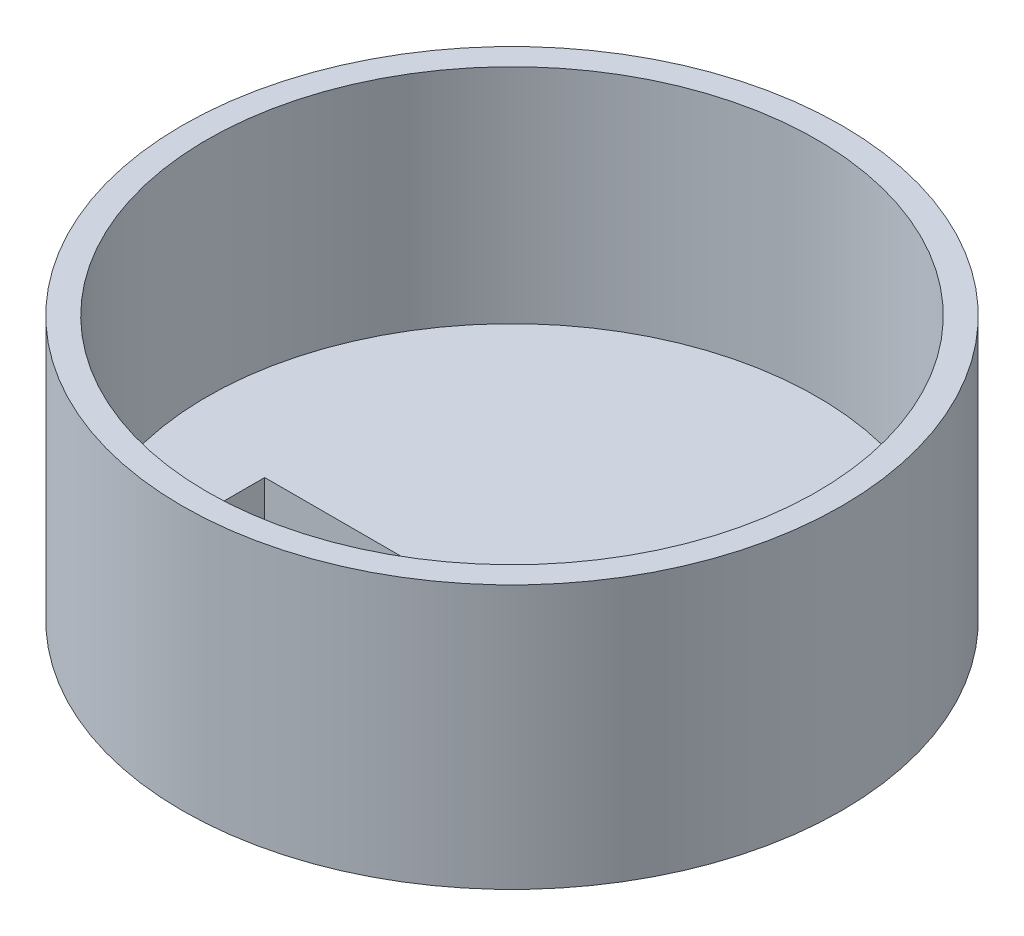
ISO-10303-21;
HEADER;
FILE_DESCRIPTION(('STEP AP214'),'2;1');
FILE_NAME('part.step','',(''),(''),'','','');
FILE_SCHEMA(('AUTOMOTIVE_DESIGN { 1 0 10303 214 1 1 1 1 }'));
ENDSEC;
DATA;
#1=APPLICATION_CONTEXT('core data for automotive mechanical design processes');
#2=APPLICATION_PROTOCOL_DEFINITION('international standard','automotive_design',2000,#1);
#3=PRODUCT_CONTEXT('',#1,'mechanical');
#4=PRODUCT('Part','Part','',(#3));
#5=PRODUCT_RELATED_PRODUCT_CATEGORY('part','',(#4));
#6=PRODUCT_DEFINITION_FORMATION('','',#4);
#7=PRODUCT_DEFINITION_CONTEXT('part definition',#1,'design');
#8=PRODUCT_DEFINITION('design','',#6,#7);
#9=PRODUCT_DEFINITION_SHAPE('','',#8);
#10=(LENGTH_UNIT() NAMED_UNIT(*) SI_UNIT(.MILLI.,.METRE.));
#11=(NAMED_UNIT(*) PLANE_ANGLE_UNIT() SI_UNIT($,.RADIAN.));
#12=(NAMED_UNIT(*) SI_UNIT($,.STERADIAN.) SOLID_ANGLE_UNIT());
#13=UNCERTAINTY_MEASURE_WITH_UNIT(LENGTH_MEASURE(1.E-05),#10,'distance_accuracy_value','');
#14=(GEOMETRIC_REPRESENTATION_CONTEXT(3) GLOBAL_UNCERTAINTY_ASSIGNED_CONTEXT((#13)) GLOBAL_UNIT_ASSIGNED_CONTEXT((#10,
#11,#12)) REPRESENTATION_CONTEXT('',''));
#15=CARTESIAN_POINT('',(0.,0.,0.));
#16=DIRECTION('',(0.,0.,1.));
#17=DIRECTION('',(1.,0.,0.));
#18=AXIS2_PLACEMENT_3D('',#15,#16,#17);
#19=CARTESIAN_POINT('',(-5.36210035518009,-1.,23.4390150982303));
#20=DIRECTION('',(0.,1.,0.));
#21=DIRECTION('',(0.,0.,1.));
#22=AXIS2_PLACEMENT_3D('',#19,#20,#21);
#23=PLANE('',#22);
#24=DIRECTION('',(0.,0.,1.));
#25=VECTOR('',#24,1.);
#26=CARTESIAN_POINT('',(-3.5,-1.,2.49999999999999));
#27=LINE('',#26,#25);
#28=CARTESIAN_POINT('',(-3.5,-1.,2.49999999999999));
#29=VERTEX_POINT('',#28);
#30=CARTESIAN_POINT('',(-3.5,-1.,17.5));
#31=VERTEX_POINT('',#30);
#32=EDGE_CURVE('E255',#29,#31,#27,.T.);
#33=ORIENTED_EDGE('',*,*,#32,.F.);
#34=DIRECTION('',(1.,0.,0.));
#35=VECTOR('',#34,1.);
#36=CARTESIAN_POINT('',(-3.5,-1.,2.49999999999999));
#37=LINE('',#36,#35);
#38=CARTESIAN_POINT('',(-26.5,-1.,2.49999999999999));
#39=VERTEX_POINT('',#38);
#40=EDGE_CURVE('E261',#39,#29,#37,.T.);
#41=ORIENTED_EDGE('',*,*,#40,.F.);
#42=DIRECTION('',(0.,0.,-1.));
#43=VECTOR('',#42,1.);
#44=CARTESIAN_POINT('',(-26.5,-1.,2.49999999999999));
#45=LINE('',#44,#43);
#46=CARTESIAN_POINT('',(-26.5,-1.,17.5));
#47=VERTEX_POINT('',#46);
#48=EDGE_CURVE('E278',#47,#39,#45,.T.);
#49=ORIENTED_EDGE('',*,*,#48,.F.);
#50=DIRECTION('',(-1.,0.,0.));
#51=VECTOR('',#50,1.);
#52=CARTESIAN_POINT('',(-3.5,-1.,17.5));
#53=LINE('',#52,#51);
#54=EDGE_CURVE('E274',#31,#47,#53,.T.);
#55=ORIENTED_EDGE('',*,*,#54,.F.);
#56=EDGE_LOOP('',(#33,#41,#49,#55));
#57=FACE_BOUND('',#56,.T.);
#58=CARTESIAN_POINT('',(2.58566802347337,-1.,14.3443011778405));
#59=CARTESIAN_POINT('',(1.36427446618725,-1.,8.53444163712361));
#60=CARTESIAN_POINT('',(-0.198470948038561,-1.,-2.10864729613163));
#61=CARTESIAN_POINT('',(13.6703917977117,-1.,0.501799814781554));
#62=CARTESIAN_POINT('',(20.6021686683192,-1.,0.456955561688108));
#63=CARTESIAN_POINT('',(30.7786877169753,-1.,-1.04330020599471));
#64=CARTESIAN_POINT('',(29.8532467146102,-1.,6.72951117522861));
#65=CARTESIAN_POINT('',(29.6566142540288,-1.,12.1804673500477));
#66=CARTESIAN_POINT('',(31.446966250817,-1.,17.236483626006));
#67=CARTESIAN_POINT('',(33.097693761807,-1.,21.9013839704548));
#68=CARTESIAN_POINT('',(27.5452937833511,-1.,26.6466321762266));
#69=CARTESIAN_POINT('',(19.0388734017149,-1.,21.2715981570248));
#70=CARTESIAN_POINT('',(9.31118788829317,-1.,23.9752678048799));
#71=CARTESIAN_POINT('',(-0.0906689007800099,-1.,23.093852030946));
#72=CARTESIAN_POINT('',(-9.38430864422489,-1.,23.9259169166535));
#73=CARTESIAN_POINT('',(-19.1308510356053,-1.,20.634216676677));
#74=CARTESIAN_POINT('',(-27.2654771250594,-1.,26.4098221695751));
#75=CARTESIAN_POINT('',(-33.2986793425028,-1.,21.7489217967745));
#76=CARTESIAN_POINT('',(-31.44206181982,-1.,16.7545588598773));
#77=CARTESIAN_POINT('',(-30.8237725474292,-1.,11.5242588910289));
#78=CARTESIAN_POINT('',(-29.2004302865499,-1.,6.23346714011981));
#79=CARTESIAN_POINT('',(-31.0806900584217,-1.,-0.909954899552583));
#80=CARTESIAN_POINT('',(-24.8199191278998,-1.,0.240703401072045));
#81=CARTESIAN_POINT('',(-19.1478382705035,-1.,0.946963345573386));
#82=CARTESIAN_POINT('',(-12.043202172285,-1.,0.22448474873068));
#83=CARTESIAN_POINT('',(-0.603012826832719,-1.,-1.58946642226845));
#84=CARTESIAN_POINT('',(-0.411714134153386,-1.,10.0019173119475));
#85=CARTESIAN_POINT('',(-2.89651142548242,-1.,18.3933971444393));
#86=CARTESIAN_POINT('',(3.53272235370927,-1.,18.6022645861089));
#87=CARTESIAN_POINT('',(2.86794465016186,-1.,15.68701953664));
#88=CARTESIAN_POINT('',(2.58566802347337,-1.,14.3443011778405));
#89=B_SPLINE_CURVE_WITH_KNOTS('',3,(#58,#59,#60,#61,#62,#63,#64,#65,#66,#67,#68,#69,#70,#71,#72,
#73,#74,#75,#76,#77,#78,#79,#80,#81,#82,#83,#84,#85,#86,#87,#88),.UNSPECIFIED.,.T.,.F.,(4,1,1,1,
1,1,1,1,1,1,1,1,1,1,1,1,1,1,1,1,1,1,1,1,1,1,1,1,4),(0.,0.0716446828108782,0.112352981719703,
0.167635856781071,0.200467621117315,0.225175545360288,0.260861667415498,0.287096674703429,
0.305438816575635,0.328540715766252,0.37335303988331,0.434051312506229,0.473333741811351,
0.513734662105038,0.573284023787942,0.616414277708655,0.643022173000441,0.658048674768701,
0.690377742346138,0.721297129536385,0.748243777610526,0.76583378331187,0.795666761125788,
0.841017232921135,0.87409780991532,0.94543754740781,0.962596858960424,0.983442176141032,1.),.UNSPECIFIED.);
#90=CARTESIAN_POINT('',(2.58566802347337,-1.,14.3443011778405));
#91=VERTEX_POINT('',#90);
#92=EDGE_CURVE('E320',#91,#91,#89,.T.);
#93=ORIENTED_EDGE('',*,*,#92,.T.);
#94=EDGE_LOOP('',(#93));
#95=FACE_BOUND('',#94,.T.);
#96=DIRECTION('',(0.,0.,-1.));
#97=VECTOR('',#96,1.);
#98=CARTESIAN_POINT('',(3.5,-1.,2.5));
#99=LINE('',#98,#97);
#100=CARTESIAN_POINT('',(3.5,-1.,17.5));
#101=VERTEX_POINT('',#100);
#102=CARTESIAN_POINT('',(3.5,-1.,2.5));
#103=VERTEX_POINT('',#102);
#104=EDGE_CURVE('E199',#101,#103,#99,.T.);
#105=ORIENTED_EDGE('',*,*,#104,.F.);
#106=DIRECTION('',(-1.,0.,0.));
#107=VECTOR('',#106,1.);
#108=CARTESIAN_POINT('',(3.5,-1.,17.5));
#109=LINE('',#108,#107);
#110=CARTESIAN_POINT('',(26.5,-1.,17.5));
#111=VERTEX_POINT('',#110);
#112=EDGE_CURVE('E216',#111,#101,#109,.T.);
#113=ORIENTED_EDGE('',*,*,#112,.F.);
#114=DIRECTION('',(0.,0.,1.));
#115=VECTOR('',#114,1.);
#116=CARTESIAN_POINT('',(26.5,-1.,2.5));
#117=LINE('',#116,#115);
#118=CARTESIAN_POINT('',(26.5,-1.,2.5));
#119=VERTEX_POINT('',#118);
#120=EDGE_CURVE('E233',#119,#111,#117,.T.);
#121=ORIENTED_EDGE('',*,*,#120,.F.);
#122=DIRECTION('',(1.,0.,0.));
#123=VECTOR('',#122,1.);
#124=CARTESIAN_POINT('',(3.5,-1.,2.5));
#125=LINE('',#124,#123);
#126=EDGE_CURVE('E229',#103,#119,#125,.T.);
#127=ORIENTED_EDGE('',*,*,#126,.F.);
#128=EDGE_LOOP('',(#105,#113,#121,#127));
#129=FACE_BOUND('',#128,.T.);
#130=ADVANCED_FACE('F45',(#57,#95,#129),#23,.F.);
#131=CARTESIAN_POINT('',(0.,30.,0.));
#132=DIRECTION('',(0.,-1.,0.));
#133=DIRECTION('',(0.,0.,-1.));
#134=AXIS2_PLACEMENT_3D('',#131,#132,#133);
#135=CYLINDRICAL_SURFACE('',#134,40.);
#136=CARTESIAN_POINT('',(0.,30.,0.));
#137=DIRECTION('',(0.,1.,0.));
#138=DIRECTION('',(0.,0.,1.));
#139=AXIS2_PLACEMENT_3D('',#136,#137,#138);
#140=CIRCLE('',#139,40.);
#141=CARTESIAN_POINT('',(0.,30.,40.));
#142=VERTEX_POINT('',#141);
#143=EDGE_CURVE('E725',#142,#142,#140,.T.);
#144=ORIENTED_EDGE('',*,*,#143,.F.);
#145=EDGE_LOOP('',(#144));
#146=FACE_BOUND('',#145,.T.);
#147=CARTESIAN_POINT('',(0.,-2.,0.));
#148=DIRECTION('',(0.,-1.,0.));
#149=DIRECTION('',(0.,0.,-1.));
#150=AXIS2_PLACEMENT_3D('',#147,#148,#149);
#151=CIRCLE('',#150,40.);
#152=CARTESIAN_POINT('',(0.,-2.,-40.));
#153=VERTEX_POINT('',#152);
#154=EDGE_CURVE('E305',#153,#153,#151,.T.);
#155=ORIENTED_EDGE('',*,*,#154,.F.);
#156=EDGE_LOOP('',(#155));
#157=FACE_BOUND('',#156,.T.);
#158=ADVANCED_FACE('F47',(#146,#157),#135,.T.);
#159=CARTESIAN_POINT('',(0.,30.,0.));
#160=DIRECTION('',(0.,1.,0.));
#161=DIRECTION('',(0.,0.,1.));
#162=AXIS2_PLACEMENT_3D('',#159,#160,#161);
#163=PLANE('',#162);
#164=CARTESIAN_POINT('',(0.,30.,0.));
#165=DIRECTION('',(0.,1.,0.));
#166=DIRECTION('',(0.,0.,1.));
#167=AXIS2_PLACEMENT_3D('',#164,#165,#166);
#168=CIRCLE('',#167,37.);
#169=CARTESIAN_POINT('',(0.,30.,37.));
#170=VERTEX_POINT('',#169);
#171=EDGE_CURVE('E730',#170,#170,#168,.T.);
#172=ORIENTED_EDGE('',*,*,#171,.F.);
#173=EDGE_LOOP('',(#172));
#174=FACE_BOUND('',#173,.T.);
#175=ORIENTED_EDGE('',*,*,#143,.T.);
#176=EDGE_LOOP('',(#175));
#177=FACE_BOUND('',#176,.T.);
#178=ADVANCED_FACE('F407',(#174,#177),#163,.T.);
#179=CARTESIAN_POINT('',(0.,3.,0.));
#180=DIRECTION('',(0.,1.,0.));
#181=DIRECTION('',(0.,0.,1.));
#182=AXIS2_PLACEMENT_3D('',#179,#180,#181);
#183=CYLINDRICAL_SURFACE('',#182,37.);
#184=CARTESIAN_POINT('',(0.,3.,0.));
#185=DIRECTION('',(0.,1.,0.));
#186=DIRECTION('',(0.,0.,1.));
#187=AXIS2_PLACEMENT_3D('',#184,#185,#186);
#188=CIRCLE('',#187,37.);
#189=CARTESIAN_POINT('',(0.,3.,37.));
#190=VERTEX_POINT('',#189);
#191=EDGE_CURVE('E729',#190,#190,#188,.T.);
#192=ORIENTED_EDGE('',*,*,#191,.F.);
#193=EDGE_LOOP('',(#192));
#194=FACE_BOUND('',#193,.T.);
#195=ORIENTED_EDGE('',*,*,#171,.T.);
#196=EDGE_LOOP('',(#195));
#197=FACE_BOUND('',#196,.T.);
#198=ADVANCED_FACE('F403',(#194,#197),#183,.F.);
#199=CARTESIAN_POINT('',(0.,3.,0.));
#200=DIRECTION('',(0.,1.,0.));
#201=DIRECTION('',(0.,0.,1.));
#202=AXIS2_PLACEMENT_3D('',#199,#200,#201);
#203=PLANE('',#202);
#204=DIRECTION('',(0.,0.,1.));
#205=VECTOR('',#204,1.);
#206=CARTESIAN_POINT('',(5.,3.,0.));
#207=LINE('',#206,#205);
#208=CARTESIAN_POINT('',(5.,3.,5.));
#209=VERTEX_POINT('',#208);
#210=CARTESIAN_POINT('',(5.,3.,15.));
#211=VERTEX_POINT('',#210);
#212=EDGE_CURVE('E699',#209,#211,#207,.T.);
#213=ORIENTED_EDGE('',*,*,#212,.F.);
#214=DIRECTION('',(-1.,0.,0.));
#215=VECTOR('',#214,1.);
#216=CARTESIAN_POINT('',(0.,3.,5.));
#217=LINE('',#216,#215);
#218=CARTESIAN_POINT('',(25.,3.,5.));
#219=VERTEX_POINT('',#218);
#220=EDGE_CURVE('E709',#219,#209,#217,.T.);
#221=ORIENTED_EDGE('',*,*,#220,.F.);
#222=DIRECTION('',(0.,0.,-1.));
#223=VECTOR('',#222,1.);
#224=CARTESIAN_POINT('',(25.,3.,0.));
#225=LINE('',#224,#223);
#226=CARTESIAN_POINT('',(25.,3.,15.));
#227=VERTEX_POINT('',#226);
#228=EDGE_CURVE('E170',#227,#219,#225,.T.);
#229=ORIENTED_EDGE('',*,*,#228,.F.);
#230=DIRECTION('',(1.,0.,0.));
#231=VECTOR('',#230,1.);
#232=CARTESIAN_POINT('',(0.,3.,15.));
#233=LINE('',#232,#231);
#234=EDGE_CURVE('E701',#211,#227,#233,.T.);
#235=ORIENTED_EDGE('',*,*,#234,.F.);
#236=EDGE_LOOP('',(#213,#221,#229,#235));
#237=FACE_BOUND('',#236,.T.);
#238=DIRECTION('',(0.,0.,-1.));
#239=VECTOR('',#238,1.);
#240=CARTESIAN_POINT('',(-5.,3.,0.));
#241=LINE('',#240,#239);
#242=CARTESIAN_POINT('',(-5.,3.,15.));
#243=VERTEX_POINT('',#242);
#244=CARTESIAN_POINT('',(-5.,3.,5.));
#245=VERTEX_POINT('',#244);
#246=EDGE_CURVE('E712',#243,#245,#241,.T.);
#247=ORIENTED_EDGE('',*,*,#246,.F.);
#248=DIRECTION('',(1.,0.,0.));
#249=VECTOR('',#248,1.);
#250=CARTESIAN_POINT('',(0.,3.,15.));
#251=LINE('',#250,#249);
#252=CARTESIAN_POINT('',(-25.,3.,15.));
#253=VERTEX_POINT('',#252);
#254=EDGE_CURVE('E722',#253,#243,#251,.T.);
#255=ORIENTED_EDGE('',*,*,#254,.F.);
#256=DIRECTION('',(0.,0.,1.));
#257=VECTOR('',#256,1.);
#258=CARTESIAN_POINT('',(-25.,3.,0.));
#259=LINE('',#258,#257);
#260=CARTESIAN_POINT('',(-25.,3.,5.));
#261=VERTEX_POINT('',#260);
#262=EDGE_CURVE('E718',#261,#253,#259,.T.);
#263=ORIENTED_EDGE('',*,*,#262,.F.);
#264=DIRECTION('',(-1.,0.,0.));
#265=VECTOR('',#264,1.);
#266=CARTESIAN_POINT('',(0.,3.,5.));
#267=LINE('',#266,#265);
#268=EDGE_CURVE('E715',#245,#261,#267,.T.);
#269=ORIENTED_EDGE('',*,*,#268,.F.);
#270=EDGE_LOOP('',(#247,#255,#263,#269));
#271=FACE_BOUND('',#270,.T.);
#272=ORIENTED_EDGE('',*,*,#191,.T.);
#273=EDGE_LOOP('',(#272));
#274=FACE_BOUND('',#273,.T.);
#275=ADVANCED_FACE('F399',(#237,#271,#274),#203,.T.);
#276=CARTESIAN_POINT('',(-5.,10.,5.));
#277=DIRECTION('',(1.,0.,0.));
#278=DIRECTION('',(0.,0.,-1.));
#279=AXIS2_PLACEMENT_3D('',#276,#277,#278);
#280=PLANE('',#279);
#281=DIRECTION('',(0.,-1.,0.));
#282=VECTOR('',#281,1.);
#283=CARTESIAN_POINT('',(-5.,10.,15.));
#284=LINE('',#283,#282);
#285=CARTESIAN_POINT('',(-5.,-2.,15.));
#286=VERTEX_POINT('',#285);
#287=EDGE_CURVE('E362',#243,#286,#284,.T.);
#288=ORIENTED_EDGE('',*,*,#287,.F.);
#289=ORIENTED_EDGE('',*,*,#246,.T.);
#290=DIRECTION('',(0.,-1.,0.));
#291=VECTOR('',#290,1.);
#292=CARTESIAN_POINT('',(-5.,10.,5.));
#293=LINE('',#292,#291);
#294=CARTESIAN_POINT('',(-5.,-2.,5.));
#295=VERTEX_POINT('',#294);
#296=EDGE_CURVE('E745',#245,#295,#293,.T.);
#297=ORIENTED_EDGE('',*,*,#296,.T.);
#298=DIRECTION('',(0.,0.,-1.));
#299=VECTOR('',#298,1.);
#300=CARTESIAN_POINT('',(-5.,-2.,5.));
#301=LINE('',#300,#299);
#302=EDGE_CURVE('E200',#286,#295,#301,.T.);
#303=ORIENTED_EDGE('',*,*,#302,.F.);
#304=EDGE_LOOP('',(#288,#289,#297,#303));
#305=FACE_BOUND('',#304,.T.);
#306=ADVANCED_FACE('F390',(#305),#280,.F.);
#307=CARTESIAN_POINT('',(-5.,10.,5.));
#308=DIRECTION('',(0.,0.,-1.));
#309=DIRECTION('',(-1.,0.,0.));
#310=AXIS2_PLACEMENT_3D('',#307,#308,#309);
#311=PLANE('',#310);
#312=ORIENTED_EDGE('',*,*,#296,.F.);
#313=ORIENTED_EDGE('',*,*,#268,.T.);
#314=DIRECTION('',(0.,-1.,0.));
#315=VECTOR('',#314,1.);
#316=CARTESIAN_POINT('',(-25.,10.,5.));
#317=LINE('',#316,#315);
#318=CARTESIAN_POINT('',(-25.,-2.,5.));
#319=VERTEX_POINT('',#318);
#320=EDGE_CURVE('E63',#261,#319,#317,.T.);
#321=ORIENTED_EDGE('',*,*,#320,.T.);
#322=DIRECTION('',(-1.,0.,0.));
#323=VECTOR('',#322,1.);
#324=CARTESIAN_POINT('',(-5.,-2.,5.));
#325=LINE('',#324,#323);
#326=EDGE_CURVE('E204',#295,#319,#325,.T.);
#327=ORIENTED_EDGE('',*,*,#326,.F.);
#328=EDGE_LOOP('',(#312,#313,#321,#327));
#329=FACE_BOUND('',#328,.T.);
#330=ADVANCED_FACE('F386',(#329),#311,.F.);
#331=CARTESIAN_POINT('',(-25.,10.,5.));
#332=DIRECTION('',(-1.,0.,0.));
#333=DIRECTION('',(0.,0.,1.));
#334=AXIS2_PLACEMENT_3D('',#331,#332,#333);
#335=PLANE('',#334);
#336=ORIENTED_EDGE('',*,*,#320,.F.);
#337=ORIENTED_EDGE('',*,*,#262,.T.);
#338=DIRECTION('',(0.,-1.,0.));
#339=VECTOR('',#338,1.);
#340=CARTESIAN_POINT('',(-25.,10.,15.));
#341=LINE('',#340,#339);
#342=CARTESIAN_POINT('',(-25.,-2.,15.));
#343=VERTEX_POINT('',#342);
#344=EDGE_CURVE('E740',#253,#343,#341,.T.);
#345=ORIENTED_EDGE('',*,*,#344,.T.);
#346=DIRECTION('',(0.,0.,1.));
#347=VECTOR('',#346,1.);
#348=CARTESIAN_POINT('',(-25.,-2.,5.));
#349=LINE('',#348,#347);
#350=EDGE_CURVE('E192',#319,#343,#349,.T.);
#351=ORIENTED_EDGE('',*,*,#350,.F.);
#352=EDGE_LOOP('',(#336,#337,#345,#351));
#353=FACE_BOUND('',#352,.T.);
#354=ADVANCED_FACE('F389',(#353),#335,.F.);
#355=CARTESIAN_POINT('',(-5.,10.,15.));
#356=DIRECTION('',(0.,0.,1.));
#357=DIRECTION('',(1.,0.,0.));
#358=AXIS2_PLACEMENT_3D('',#355,#356,#357);
#359=PLANE('',#358);
#360=ORIENTED_EDGE('',*,*,#344,.F.);
#361=ORIENTED_EDGE('',*,*,#254,.T.);
#362=ORIENTED_EDGE('',*,*,#287,.T.);
#363=DIRECTION('',(1.,0.,0.));
#364=VECTOR('',#363,1.);
#365=CARTESIAN_POINT('',(-5.,-2.,15.));
#366=LINE('',#365,#364);
#367=EDGE_CURVE('E188',#343,#286,#366,.T.);
#368=ORIENTED_EDGE('',*,*,#367,.F.);
#369=EDGE_LOOP('',(#360,#361,#362,#368));
#370=FACE_BOUND('',#369,.T.);
#371=ADVANCED_FACE('F384',(#370),#359,.F.);
#372=CARTESIAN_POINT('',(5.,10.,5.));
#373=DIRECTION('',(-1.,0.,0.));
#374=DIRECTION('',(0.,0.,1.));
#375=AXIS2_PLACEMENT_3D('',#372,#373,#374);
#376=PLANE('',#375);
#377=DIRECTION('',(0.,-1.,0.));
#378=VECTOR('',#377,1.);
#379=CARTESIAN_POINT('',(5.,10.,5.));
#380=LINE('',#379,#378);
#381=CARTESIAN_POINT('',(5.,-2.,5.));
#382=VERTEX_POINT('',#381);
#383=EDGE_CURVE('E71',#209,#382,#380,.T.);
#384=ORIENTED_EDGE('',*,*,#383,.F.);
#385=ORIENTED_EDGE('',*,*,#212,.T.);
#386=DIRECTION('',(0.,-1.,0.));
#387=VECTOR('',#386,1.);
#388=CARTESIAN_POINT('',(5.,10.,15.));
#389=LINE('',#388,#387);
#390=CARTESIAN_POINT('',(5.,-2.,15.));
#391=VERTEX_POINT('',#390);
#392=EDGE_CURVE('E734',#211,#391,#389,.T.);
#393=ORIENTED_EDGE('',*,*,#392,.T.);
#394=DIRECTION('',(0.,0.,1.));
#395=VECTOR('',#394,1.);
#396=CARTESIAN_POINT('',(5.,-2.,5.));
#397=LINE('',#396,#395);
#398=EDGE_CURVE('E181',#382,#391,#397,.T.);
#399=ORIENTED_EDGE('',*,*,#398,.F.);
#400=EDGE_LOOP('',(#384,#385,#393,#399));
#401=FACE_BOUND('',#400,.T.);
#402=ADVANCED_FACE('F375',(#401),#376,.F.);
#403=CARTESIAN_POINT('',(5.,10.,15.));
#404=DIRECTION('',(0.,0.,1.));
#405=DIRECTION('',(1.,0.,0.));
#406=AXIS2_PLACEMENT_3D('',#403,#404,#405);
#407=PLANE('',#406);
#408=ORIENTED_EDGE('',*,*,#392,.F.);
#409=ORIENTED_EDGE('',*,*,#234,.T.);
#410=DIRECTION('',(0.,-1.,0.));
#411=VECTOR('',#410,1.);
#412=CARTESIAN_POINT('',(25.,10.,15.));
#413=LINE('',#412,#411);
#414=CARTESIAN_POINT('',(25.,-2.,15.));
#415=VERTEX_POINT('',#414);
#416=EDGE_CURVE('E173',#227,#415,#413,.T.);
#417=ORIENTED_EDGE('',*,*,#416,.T.);
#418=DIRECTION('',(1.,0.,0.));
#419=VECTOR('',#418,1.);
#420=CARTESIAN_POINT('',(25.,-2.,15.));
#421=LINE('',#420,#419);
#422=EDGE_CURVE('E186',#391,#415,#421,.T.);
#423=ORIENTED_EDGE('',*,*,#422,.F.);
#424=EDGE_LOOP('',(#408,#409,#417,#423));
#425=FACE_BOUND('',#424,.T.);
#426=ADVANCED_FACE('F372',(#425),#407,.F.);
#427=CARTESIAN_POINT('',(25.,10.,5.));
#428=DIRECTION('',(1.,0.,0.));
#429=DIRECTION('',(0.,0.,-1.));
#430=AXIS2_PLACEMENT_3D('',#427,#428,#429);
#431=PLANE('',#430);
#432=ORIENTED_EDGE('',*,*,#416,.F.);
#433=ORIENTED_EDGE('',*,*,#228,.T.);
#434=DIRECTION('',(0.,-1.,0.));
#435=VECTOR('',#434,1.);
#436=CARTESIAN_POINT('',(25.,10.,5.));
#437=LINE('',#436,#435);
#438=CARTESIAN_POINT('',(25.,-2.,5.));
#439=VERTEX_POINT('',#438);
#440=EDGE_CURVE('E163',#219,#439,#437,.T.);
#441=ORIENTED_EDGE('',*,*,#440,.T.);
#442=DIRECTION('',(0.,0.,-1.));
#443=VECTOR('',#442,1.);
#444=CARTESIAN_POINT('',(25.,-2.,5.));
#445=LINE('',#444,#443);
#446=EDGE_CURVE('E167',#415,#439,#445,.T.);
#447=ORIENTED_EDGE('',*,*,#446,.F.);
#448=EDGE_LOOP('',(#432,#433,#441,#447));
#449=FACE_BOUND('',#448,.T.);
#450=ADVANCED_FACE('F165',(#449),#431,.F.);
#451=CARTESIAN_POINT('',(5.,10.,5.));
#452=DIRECTION('',(0.,0.,-1.));
#453=DIRECTION('',(-1.,0.,0.));
#454=AXIS2_PLACEMENT_3D('',#451,#452,#453);
#455=PLANE('',#454);
#456=ORIENTED_EDGE('',*,*,#440,.F.);
#457=ORIENTED_EDGE('',*,*,#220,.T.);
#458=ORIENTED_EDGE('',*,*,#383,.T.);
#459=DIRECTION('',(-1.,0.,0.));
#460=VECTOR('',#459,1.);
#461=CARTESIAN_POINT('',(25.,-2.,5.));
#462=LINE('',#461,#460);
#463=EDGE_CURVE('E176',#439,#382,#462,.T.);
#464=ORIENTED_EDGE('',*,*,#463,.F.);
#465=EDGE_LOOP('',(#456,#457,#458,#464));
#466=FACE_BOUND('',#465,.T.);
#467=ADVANCED_FACE('F177',(#466),#455,.F.);
#468=CARTESIAN_POINT('',(0.,-2.,0.));
#469=DIRECTION('',(0.,-1.,0.));
#470=DIRECTION('',(0.,0.,-1.));
#471=AXIS2_PLACEMENT_3D('',#468,#469,#470);
#472=PLANE('',#471);
#473=ORIENTED_EDGE('',*,*,#154,.T.);
#474=EDGE_LOOP('',(#473));
#475=FACE_BOUND('',#474,.T.);
#476=CARTESIAN_POINT('',(0.,-2.,0.));
#477=DIRECTION('',(0.,-1.,0.));
#478=DIRECTION('',(0.,0.,-1.));
#479=AXIS2_PLACEMENT_3D('',#476,#477,#478);
#480=CIRCLE('',#479,39.);
#481=CARTESIAN_POINT('',(0.,-2.,-39.));
#482=VERTEX_POINT('',#481);
#483=EDGE_CURVE('E301',#482,#482,#480,.T.);
#484=ORIENTED_EDGE('',*,*,#483,.F.);
#485=EDGE_LOOP('',(#484));
#486=FACE_BOUND('',#485,.T.);
#487=ADVANCED_FACE('F381',(#475,#486),#472,.T.);
#488=CARTESIAN_POINT('',(0.,-2.,0.));
#489=DIRECTION('',(0.,1.,0.));
#490=DIRECTION('',(0.,0.,1.));
#491=AXIS2_PLACEMENT_3D('',#488,#489,#490);
#492=CYLINDRICAL_SURFACE('',#491,39.);
#493=ORIENTED_EDGE('',*,*,#483,.T.);
#494=EDGE_LOOP('',(#493));
#495=FACE_BOUND('',#494,.T.);
#496=CARTESIAN_POINT('',(0.,0.,0.));
#497=DIRECTION('',(0.,-1.,0.));
#498=DIRECTION('',(0.,0.,-1.));
#499=AXIS2_PLACEMENT_3D('',#496,#497,#498);
#500=CIRCLE('',#499,39.);
#501=CARTESIAN_POINT('',(0.,0.,-39.));
#502=VERTEX_POINT('',#501);
#503=EDGE_CURVE('E300',#502,#502,#500,.T.);
#504=ORIENTED_EDGE('',*,*,#503,.F.);
#505=EDGE_LOOP('',(#504));
#506=FACE_BOUND('',#505,.T.);
#507=ADVANCED_FACE('F427',(#495,#506),#492,.F.);
#508=CARTESIAN_POINT('',(-0.21380341809468,0.,-23.823786826234));
#509=DIRECTION('',(0.,1.,0.));
#510=DIRECTION('',(0.,0.,1.));
#511=AXIS2_PLACEMENT_3D('',#508,#509,#510);
#512=PLANE('',#511);
#513=CARTESIAN_POINT('',(0.,0.,-17.9149855912083));
#514=CARTESIAN_POINT('',(-11.3690616938996,0.,-17.9186668380735));
#515=CARTESIAN_POINT('',(-35.3589700199505,0.,5.24783574066209));
#516=CARTESIAN_POINT('',(-0.0843608021175998,0.,-39.0645151739557));
#517=CARTESIAN_POINT('',(35.1853949113494,0.,4.98271763490243));
#518=CARTESIAN_POINT('',(11.2972704930844,0.,-17.9113275899847));
#519=CARTESIAN_POINT('',(0.,0.,-17.9149855912083));
#520=B_SPLINE_CURVE_WITH_KNOTS('',3,(#513,#514,#515,#516,#517,#518,#519),.UNSPECIFIED.,.T.,.F.,
(4,1,1,1,4),(0.,0.237457408033925,0.501542261338866,0.764042043101463,1.),.UNSPECIFIED.);
#521=CARTESIAN_POINT('',(0.,0.,-17.9149855912083));
#522=VERTEX_POINT('',#521);
#523=EDGE_CURVE('E313',#522,#522,#520,.T.);
#524=ORIENTED_EDGE('',*,*,#523,.T.);
#525=EDGE_LOOP('',(#524));
#526=FACE_BOUND('',#525,.T.);
#527=ADVANCED_FACE('F333',(#526),#512,.F.);
#528=DIRECTION('',(0.,-1.,0.));
#529=VECTOR('',#528,1.);
#530=SURFACE_OF_LINEAR_EXTRUSION('',#520,#529);
#531=ORIENTED_EDGE('',*,*,#523,.F.);
#532=EDGE_LOOP('',(#531));
#533=FACE_BOUND('',#532,.T.);
#534=CARTESIAN_POINT('',(0.,-2.,-17.9149855912083));
#535=CARTESIAN_POINT('',(-11.3690616938996,-2.,-17.9186668380735));
#536=CARTESIAN_POINT('',(-35.3589700199505,-2.,5.24783574066209));
#537=CARTESIAN_POINT('',(-0.0843608021175998,-2.,-39.0645151739557));
#538=CARTESIAN_POINT('',(35.1853949113494,-2.,4.98271763490243));
#539=CARTESIAN_POINT('',(11.2972704930844,-2.,-17.9113275899847));
#540=CARTESIAN_POINT('',(0.,-2.,-17.9149855912083));
#541=B_SPLINE_CURVE_WITH_KNOTS('',3,(#534,#535,#536,#537,#538,#539,#540),.UNSPECIFIED.,.T.,.F.,
(4,1,1,1,4),(0.,0.237457408033925,0.501542261338866,0.764042043101463,1.),.UNSPECIFIED.);
#542=CARTESIAN_POINT('',(0.,-2.,-17.9149855912083));
#543=VERTEX_POINT('',#542);
#544=EDGE_CURVE('E312',#543,#543,#541,.T.);
#545=ORIENTED_EDGE('',*,*,#544,.T.);
#546=EDGE_LOOP('',(#545));
#547=FACE_BOUND('',#546,.T.);
#548=ADVANCED_FACE('F328',(#533,#547),#530,.F.);
#549=CARTESIAN_POINT('',(24.5262213126633,-2.,-8.3923263655927));
#550=DIRECTION('',(0.,-1.,0.));
#551=DIRECTION('',(0.,0.,-1.));
#552=AXIS2_PLACEMENT_3D('',#549,#550,#551);
#553=PLANE('',#552);
#554=ORIENTED_EDGE('',*,*,#544,.F.);
#555=EDGE_LOOP('',(#554));
#556=FACE_BOUND('',#555,.T.);
#557=CARTESIAN_POINT('',(-25.,-2.,-5.50700178551411));
#558=CARTESIAN_POINT('',(-27.0417123815534,-2.,-7.29366309555986));
#559=CARTESIAN_POINT('',(0.307174997231349,-2.,-46.7752967556079));
#560=CARTESIAN_POINT('',(37.697617145817,-2.,8.43132190937866));
#561=CARTESIAN_POINT('',(0.0904347004889322,-2.,-24.3679103189458));
#562=CARTESIAN_POINT('',(-23.3625575704365,-2.,-4.07410895361451));
#563=CARTESIAN_POINT('',(-25.,-2.,-5.50700178551411));
#564=B_SPLINE_CURVE_WITH_KNOTS('',3,(#557,#558,#559,#560,#561,#562,#563),.UNSPECIFIED.,.T.,.F.,
(4,1,1,1,4),(0.,0.28003383855532,0.55476271473193,0.775414356543617,1.),.UNSPECIFIED.);
#565=CARTESIAN_POINT('',(-25.,-2.,-5.50700178551411));
#566=VERTEX_POINT('',#565);
#567=EDGE_CURVE('E352',#566,#566,#564,.T.);
#568=ORIENTED_EDGE('',*,*,#567,.T.);
#569=EDGE_LOOP('',(#568));
#570=FACE_BOUND('',#569,.T.);
#571=ADVANCED_FACE('F332',(#556,#570),#553,.T.);
#572=DIRECTION('',(0.,1.,0.));
#573=VECTOR('',#572,1.);
#574=SURFACE_OF_LINEAR_EXTRUSION('',#564,#573);
#575=ORIENTED_EDGE('',*,*,#567,.F.);
#576=EDGE_LOOP('',(#575));
#577=FACE_BOUND('',#576,.T.);
#578=CARTESIAN_POINT('',(-25.,0.,-5.50700178551411));
#579=CARTESIAN_POINT('',(-27.0417123815534,0.,-7.29366309555986));
#580=CARTESIAN_POINT('',(0.307174997231349,0.,-46.7752967556079));
#581=CARTESIAN_POINT('',(37.697617145817,0.,8.43132190937866));
#582=CARTESIAN_POINT('',(0.0904347004889322,0.,-24.3679103189458));
#583=CARTESIAN_POINT('',(-23.3625575704365,0.,-4.07410895361451));
#584=CARTESIAN_POINT('',(-25.,0.,-5.50700178551411));
#585=B_SPLINE_CURVE_WITH_KNOTS('',3,(#578,#579,#580,#581,#582,#583,#584),.UNSPECIFIED.,.T.,.F.,
(4,1,1,1,4),(0.,0.28003383855532,0.55476271473193,0.775414356543617,1.),.UNSPECIFIED.);
#586=CARTESIAN_POINT('',(-25.,0.,-5.50700178551411));
#587=VERTEX_POINT('',#586);
#588=EDGE_CURVE('E56',#587,#587,#585,.T.);
#589=ORIENTED_EDGE('',*,*,#588,.T.);
#590=EDGE_LOOP('',(#589));
#591=FACE_BOUND('',#590,.T.);
#592=ADVANCED_FACE('F343',(#577,#591),#574,.F.);
#593=DIRECTION('',(0.,1.,0.));
#594=VECTOR('',#593,1.);
#595=SURFACE_OF_LINEAR_EXTRUSION('',#89,#594);
#596=ORIENTED_EDGE('',*,*,#92,.F.);
#597=EDGE_LOOP('',(#596));
#598=FACE_BOUND('',#597,.T.);
#599=CARTESIAN_POINT('',(2.58566802347337,0.,14.3443011778405));
#600=CARTESIAN_POINT('',(1.36427446618725,0.,8.53444163712361));
#601=CARTESIAN_POINT('',(-0.198470948038561,0.,-2.10864729613163));
#602=CARTESIAN_POINT('',(13.6703917977117,0.,0.501799814781554));
#603=CARTESIAN_POINT('',(20.6021686683192,0.,0.456955561688108));
#604=CARTESIAN_POINT('',(30.7786877169753,0.,-1.04330020599471));
#605=CARTESIAN_POINT('',(29.8532467146102,0.,6.72951117522861));
#606=CARTESIAN_POINT('',(29.6566142540288,0.,12.1804673500477));
#607=CARTESIAN_POINT('',(31.446966250817,0.,17.236483626006));
#608=CARTESIAN_POINT('',(33.097693761807,0.,21.9013839704548));
#609=CARTESIAN_POINT('',(27.5452937833511,0.,26.6466321762266));
#610=CARTESIAN_POINT('',(19.0388734017149,0.,21.2715981570248));
#611=CARTESIAN_POINT('',(9.31118788829317,0.,23.9752678048799));
#612=CARTESIAN_POINT('',(-0.0906689007800099,0.,23.093852030946));
#613=CARTESIAN_POINT('',(-9.38430864422489,0.,23.9259169166535));
#614=CARTESIAN_POINT('',(-19.1308510356053,0.,20.634216676677));
#615=CARTESIAN_POINT('',(-27.2654771250594,0.,26.4098221695751));
#616=CARTESIAN_POINT('',(-33.2986793425028,0.,21.7489217967745));
#617=CARTESIAN_POINT('',(-31.44206181982,0.,16.7545588598773));
#618=CARTESIAN_POINT('',(-30.8237725474292,0.,11.5242588910289));
#619=CARTESIAN_POINT('',(-29.2004302865499,0.,6.23346714011981));
#620=CARTESIAN_POINT('',(-31.0806900584217,0.,-0.909954899552583));
#621=CARTESIAN_POINT('',(-24.8199191278998,0.,0.240703401072045));
#622=CARTESIAN_POINT('',(-19.1478382705035,0.,0.946963345573386));
#623=CARTESIAN_POINT('',(-12.043202172285,0.,0.22448474873068));
#624=CARTESIAN_POINT('',(-0.603012826832719,0.,-1.58946642226845));
#625=CARTESIAN_POINT('',(-0.411714134153386,0.,10.0019173119475));
#626=CARTESIAN_POINT('',(-2.89651142548242,0.,18.3933971444393));
#627=CARTESIAN_POINT('',(3.53272235370927,0.,18.6022645861089));
#628=CARTESIAN_POINT('',(2.86794465016186,0.,15.68701953664));
#629=CARTESIAN_POINT('',(2.58566802347337,0.,14.3443011778405));
#630=B_SPLINE_CURVE_WITH_KNOTS('',3,(#599,#600,#601,#602,#603,#604,#605,#606,#607,#608,#609,
#610,#611,#612,#613,#614,#615,#616,#617,#618,#619,#620,#621,#622,#623,#624,#625,#626,#627,#628,
#629),.UNSPECIFIED.,.T.,.F.,(4,1,1,1,1,1,1,1,1,1,1,1,1,1,1,1,1,1,1,1,1,1,1,1,1,1,1,1,4),(0.,
0.0716446828108782,0.112352981719703,0.167635856781071,0.200467621117315,0.225175545360288,
0.260861667415498,0.287096674703429,0.305438816575635,0.328540715766252,0.37335303988331,
0.434051312506229,0.473333741811351,0.513734662105038,0.573284023787942,0.616414277708655,
0.643022173000441,0.658048674768701,0.690377742346138,0.721297129536385,0.748243777610526,
0.76583378331187,0.795666761125788,0.841017232921135,0.87409780991532,0.94543754740781,
0.962596858960424,0.983442176141032,1.),.UNSPECIFIED.);
#631=CARTESIAN_POINT('',(2.58566802347337,0.,14.3443011778405));
#632=VERTEX_POINT('',#631);
#633=EDGE_CURVE('E12',#632,#632,#630,.T.);
#634=ORIENTED_EDGE('',*,*,#633,.T.);
#635=EDGE_LOOP('',(#634));
#636=FACE_BOUND('',#635,.T.);
#637=ADVANCED_FACE('F339',(#598,#636),#595,.F.);
#638=CARTESIAN_POINT('',(0.,0.,0.));
#639=DIRECTION('',(0.,1.,0.));
#640=DIRECTION('',(0.,0.,1.));
#641=AXIS2_PLACEMENT_3D('',#638,#639,#640);
#642=PLANE('',#641);
#643=ORIENTED_EDGE('',*,*,#633,.F.);
#644=EDGE_LOOP('',(#643));
#645=FACE_BOUND('',#644,.T.);
#646=ORIENTED_EDGE('',*,*,#588,.F.);
#647=EDGE_LOOP('',(#646));
#648=FACE_BOUND('',#647,.T.);
#649=ORIENTED_EDGE('',*,*,#503,.T.);
#650=EDGE_LOOP('',(#649));
#651=FACE_BOUND('',#650,.T.);
#652=ADVANCED_FACE('F342',(#645,#648,#651),#642,.F.);
#653=CARTESIAN_POINT('',(-3.5,-2.,2.49999999999999));
#654=DIRECTION('',(-1.,0.,0.));
#655=DIRECTION('',(0.,0.,1.));
#656=AXIS2_PLACEMENT_3D('',#653,#654,#655);
#657=PLANE('',#656);
#658=ORIENTED_EDGE('',*,*,#32,.T.);
#659=DIRECTION('',(0.,1.,0.));
#660=VECTOR('',#659,1.);
#661=CARTESIAN_POINT('',(-3.5,-2.,17.5));
#662=LINE('',#661,#660);
#663=CARTESIAN_POINT('',(-3.5,-2.,17.5));
#664=VERTEX_POINT('',#663);
#665=EDGE_CURVE('E296',#664,#31,#662,.T.);
#666=ORIENTED_EDGE('',*,*,#665,.F.);
#667=DIRECTION('',(0.,0.,1.));
#668=VECTOR('',#667,1.);
#669=CARTESIAN_POINT('',(-3.5,-2.,2.49999999999999));
#670=LINE('',#669,#668);
#671=CARTESIAN_POINT('',(-3.5,-2.,2.49999999999999));
#672=VERTEX_POINT('',#671);
#673=EDGE_CURVE('E256',#672,#664,#670,.T.);
#674=ORIENTED_EDGE('',*,*,#673,.F.);
#675=DIRECTION('',(0.,1.,0.));
#676=VECTOR('',#675,1.);
#677=CARTESIAN_POINT('',(-3.5,-2.,2.49999999999999));
#678=LINE('',#677,#676);
#679=EDGE_CURVE('E270',#672,#29,#678,.T.);
#680=ORIENTED_EDGE('',*,*,#679,.T.);
#681=EDGE_LOOP('',(#658,#666,#674,#680));
#682=FACE_BOUND('',#681,.T.);
#683=ADVANCED_FACE('F412',(#682),#657,.F.);
#684=CARTESIAN_POINT('',(-3.5,-2.,17.5));
#685=DIRECTION('',(0.,0.,-1.));
#686=DIRECTION('',(-1.,0.,0.));
#687=AXIS2_PLACEMENT_3D('',#684,#685,#686);
#688=PLANE('',#687);
#689=ORIENTED_EDGE('',*,*,#54,.T.);
#690=DIRECTION('',(0.,1.,0.));
#691=VECTOR('',#690,1.);
#692=CARTESIAN_POINT('',(-26.5,-2.,17.5));
#693=LINE('',#692,#691);
#694=CARTESIAN_POINT('',(-26.5,-2.,17.5));
#695=VERTEX_POINT('',#694);
#696=EDGE_CURVE('E292',#695,#47,#693,.T.);
#697=ORIENTED_EDGE('',*,*,#696,.F.);
#698=DIRECTION('',(-1.,0.,0.));
#699=VECTOR('',#698,1.);
#700=CARTESIAN_POINT('',(-3.5,-2.,17.5));
#701=LINE('',#700,#699);
#702=EDGE_CURVE('E260',#664,#695,#701,.T.);
#703=ORIENTED_EDGE('',*,*,#702,.F.);
#704=ORIENTED_EDGE('',*,*,#665,.T.);
#705=EDGE_LOOP('',(#689,#697,#703,#704));
#706=FACE_BOUND('',#705,.T.);
#707=ADVANCED_FACE('F417',(#706),#688,.F.);
#708=CARTESIAN_POINT('',(-26.5,-2.,2.49999999999999));
#709=DIRECTION('',(1.,0.,0.));
#710=DIRECTION('',(0.,0.,-1.));
#711=AXIS2_PLACEMENT_3D('',#708,#709,#710);
#712=PLANE('',#711);
#713=ORIENTED_EDGE('',*,*,#48,.T.);
#714=DIRECTION('',(0.,1.,0.));
#715=VECTOR('',#714,1.);
#716=CARTESIAN_POINT('',(-26.5,-2.,2.49999999999999));
#717=LINE('',#716,#715);
#718=CARTESIAN_POINT('',(-26.5,-2.,2.49999999999999));
#719=VERTEX_POINT('',#718);
#720=EDGE_CURVE('E288',#719,#39,#717,.T.);
#721=ORIENTED_EDGE('',*,*,#720,.F.);
#722=DIRECTION('',(0.,0.,-1.));
#723=VECTOR('',#722,1.);
#724=CARTESIAN_POINT('',(-26.5,-2.,2.49999999999999));
#725=LINE('',#724,#723);
#726=EDGE_CURVE('E264',#695,#719,#725,.T.);
#727=ORIENTED_EDGE('',*,*,#726,.F.);
#728=ORIENTED_EDGE('',*,*,#696,.T.);
#729=EDGE_LOOP('',(#713,#721,#727,#728));
#730=FACE_BOUND('',#729,.T.);
#731=ADVANCED_FACE('F440',(#730),#712,.F.);
#732=CARTESIAN_POINT('',(-3.5,-2.,2.49999999999999));
#733=DIRECTION('',(0.,0.,1.));
#734=DIRECTION('',(1.,0.,0.));
#735=AXIS2_PLACEMENT_3D('',#732,#733,#734);
#736=PLANE('',#735);
#737=ORIENTED_EDGE('',*,*,#40,.T.);
#738=ORIENTED_EDGE('',*,*,#679,.F.);
#739=DIRECTION('',(1.,0.,0.));
#740=VECTOR('',#739,1.);
#741=CARTESIAN_POINT('',(-3.5,-2.,2.49999999999999));
#742=LINE('',#741,#740);
#743=EDGE_CURVE('E267',#719,#672,#742,.T.);
#744=ORIENTED_EDGE('',*,*,#743,.F.);
#745=ORIENTED_EDGE('',*,*,#720,.T.);
#746=EDGE_LOOP('',(#737,#738,#744,#745));
#747=FACE_BOUND('',#746,.T.);
#748=ADVANCED_FACE('F444',(#747),#736,.F.);
#749=CARTESIAN_POINT('',(0.,-2.,0.));
#750=DIRECTION('',(0.,-1.,0.));
#751=DIRECTION('',(0.,0.,-1.));
#752=AXIS2_PLACEMENT_3D('',#749,#750,#751);
#753=PLANE('',#752);
#754=ORIENTED_EDGE('',*,*,#302,.T.);
#755=ORIENTED_EDGE('',*,*,#326,.T.);
#756=ORIENTED_EDGE('',*,*,#350,.T.);
#757=ORIENTED_EDGE('',*,*,#367,.T.);
#758=EDGE_LOOP('',(#754,#755,#756,#757));
#759=FACE_BOUND('',#758,.T.);
#760=ORIENTED_EDGE('',*,*,#673,.T.);
#761=ORIENTED_EDGE('',*,*,#702,.T.);
#762=ORIENTED_EDGE('',*,*,#726,.T.);
#763=ORIENTED_EDGE('',*,*,#743,.T.);
#764=EDGE_LOOP('',(#760,#761,#762,#763));
#765=FACE_BOUND('',#764,.T.);
#766=ADVANCED_FACE('F448',(#759,#765),#753,.T.);
#767=CARTESIAN_POINT('',(3.5,-2.,2.5));
#768=DIRECTION('',(1.,0.,0.));
#769=DIRECTION('',(0.,0.,-1.));
#770=AXIS2_PLACEMENT_3D('',#767,#768,#769);
#771=PLANE('',#770);
#772=ORIENTED_EDGE('',*,*,#104,.T.);
#773=DIRECTION('',(0.,1.,0.));
#774=VECTOR('',#773,1.);
#775=CARTESIAN_POINT('',(3.5,-2.,2.5));
#776=LINE('',#775,#774);
#777=CARTESIAN_POINT('',(3.5,-2.,2.5));
#778=VERTEX_POINT('',#777);
#779=EDGE_CURVE('E251',#778,#103,#776,.T.);
#780=ORIENTED_EDGE('',*,*,#779,.F.);
#781=DIRECTION('',(0.,0.,-1.));
#782=VECTOR('',#781,1.);
#783=CARTESIAN_POINT('',(3.5,-2.,2.5));
#784=LINE('',#783,#782);
#785=CARTESIAN_POINT('',(3.5,-2.,17.5));
#786=VERTEX_POINT('',#785);
#787=EDGE_CURVE('E211',#786,#778,#784,.T.);
#788=ORIENTED_EDGE('',*,*,#787,.F.);
#789=DIRECTION('',(0.,1.,0.));
#790=VECTOR('',#789,1.);
#791=CARTESIAN_POINT('',(3.5,-2.,17.5));
#792=LINE('',#791,#790);
#793=EDGE_CURVE('E225',#786,#101,#792,.T.);
#794=ORIENTED_EDGE('',*,*,#793,.T.);
#795=EDGE_LOOP('',(#772,#780,#788,#794));
#796=FACE_BOUND('',#795,.T.);
#797=ADVANCED_FACE('F452',(#796),#771,.F.);
#798=CARTESIAN_POINT('',(3.5,-2.,2.5));
#799=DIRECTION('',(0.,0.,1.));
#800=DIRECTION('',(1.,0.,0.));
#801=AXIS2_PLACEMENT_3D('',#798,#799,#800);
#802=PLANE('',#801);
#803=ORIENTED_EDGE('',*,*,#126,.T.);
#804=DIRECTION('',(0.,1.,0.));
#805=VECTOR('',#804,1.);
#806=CARTESIAN_POINT('',(26.5,-2.,2.5));
#807=LINE('',#806,#805);
#808=CARTESIAN_POINT('',(26.5,-2.,2.5));
#809=VERTEX_POINT('',#808);
#810=EDGE_CURVE('E247',#809,#119,#807,.T.);
#811=ORIENTED_EDGE('',*,*,#810,.F.);
#812=DIRECTION('',(1.,0.,0.));
#813=VECTOR('',#812,1.);
#814=CARTESIAN_POINT('',(3.5,-2.,2.5));
#815=LINE('',#814,#813);
#816=EDGE_CURVE('E215',#778,#809,#815,.T.);
#817=ORIENTED_EDGE('',*,*,#816,.F.);
#818=ORIENTED_EDGE('',*,*,#779,.T.);
#819=EDGE_LOOP('',(#803,#811,#817,#818));
#820=FACE_BOUND('',#819,.T.);
#821=ADVANCED_FACE('F456',(#820),#802,.F.);
#822=CARTESIAN_POINT('',(26.5,-2.,2.5));
#823=DIRECTION('',(-1.,0.,0.));
#824=DIRECTION('',(0.,0.,1.));
#825=AXIS2_PLACEMENT_3D('',#822,#823,#824);
#826=PLANE('',#825);
#827=ORIENTED_EDGE('',*,*,#120,.T.);
#828=DIRECTION('',(0.,1.,0.));
#829=VECTOR('',#828,1.);
#830=CARTESIAN_POINT('',(26.5,-2.,17.5));
#831=LINE('',#830,#829);
#832=CARTESIAN_POINT('',(26.5,-2.,17.5));
#833=VERTEX_POINT('',#832);
#834=EDGE_CURVE('E243',#833,#111,#831,.T.);
#835=ORIENTED_EDGE('',*,*,#834,.F.);
#836=DIRECTION('',(0.,0.,1.));
#837=VECTOR('',#836,1.);
#838=CARTESIAN_POINT('',(26.5,-2.,2.5));
#839=LINE('',#838,#837);
#840=EDGE_CURVE('E219',#809,#833,#839,.T.);
#841=ORIENTED_EDGE('',*,*,#840,.F.);
#842=ORIENTED_EDGE('',*,*,#810,.T.);
#843=EDGE_LOOP('',(#827,#835,#841,#842));
#844=FACE_BOUND('',#843,.T.);
#845=ADVANCED_FACE('F460',(#844),#826,.F.);
#846=CARTESIAN_POINT('',(3.5,-2.,17.5));
#847=DIRECTION('',(0.,0.,-1.));
#848=DIRECTION('',(-1.,0.,0.));
#849=AXIS2_PLACEMENT_3D('',#846,#847,#848);
#850=PLANE('',#849);
#851=ORIENTED_EDGE('',*,*,#112,.T.);
#852=ORIENTED_EDGE('',*,*,#793,.F.);
#853=DIRECTION('',(-1.,0.,0.));
#854=VECTOR('',#853,1.);
#855=CARTESIAN_POINT('',(3.5,-2.,17.5));
#856=LINE('',#855,#854);
#857=EDGE_CURVE('E222',#833,#786,#856,.T.);
#858=ORIENTED_EDGE('',*,*,#857,.F.);
#859=ORIENTED_EDGE('',*,*,#834,.T.);
#860=EDGE_LOOP('',(#851,#852,#858,#859));
#861=FACE_BOUND('',#860,.T.);
#862=ADVANCED_FACE('F464',(#861),#850,.F.);
#863=CARTESIAN_POINT('',(0.,-2.,0.));
#864=DIRECTION('',(0.,1.,0.));
#865=DIRECTION('',(0.,0.,1.));
#866=AXIS2_PLACEMENT_3D('',#863,#864,#865);
#867=PLANE('',#866);
#868=ORIENTED_EDGE('',*,*,#422,.T.);
#869=ORIENTED_EDGE('',*,*,#446,.T.);
#870=ORIENTED_EDGE('',*,*,#463,.T.);
#871=ORIENTED_EDGE('',*,*,#398,.T.);
#872=EDGE_LOOP('',(#868,#869,#870,#871));
#873=FACE_BOUND('',#872,.T.);
#874=ORIENTED_EDGE('',*,*,#787,.T.);
#875=ORIENTED_EDGE('',*,*,#816,.T.);
#876=ORIENTED_EDGE('',*,*,#840,.T.);
#877=ORIENTED_EDGE('',*,*,#857,.T.);
#878=EDGE_LOOP('',(#874,#875,#876,#877));
#879=FACE_BOUND('',#878,.T.);
#880=ADVANCED_FACE('F183',(#873,#879),#867,.F.);
#881=CLOSED_SHELL('',(#130,#158,#178,#198,#275,#306,#330,#354,#371,#402,#426,#450,#467,#487,
#507,#527,#548,#571,#592,#637,#652,#683,#707,#731,#748,#766,#797,#821,#845,#862,#880));
#882=MANIFOLD_SOLID_BREP('B2',#881);
#883=ADVANCED_BREP_SHAPE_REPRESENTATION('',(#18,#882),#14);
#884=SHAPE_DEFINITION_REPRESENTATION(#9,#883);
ENDSEC;
END-ISO-10303-21;
